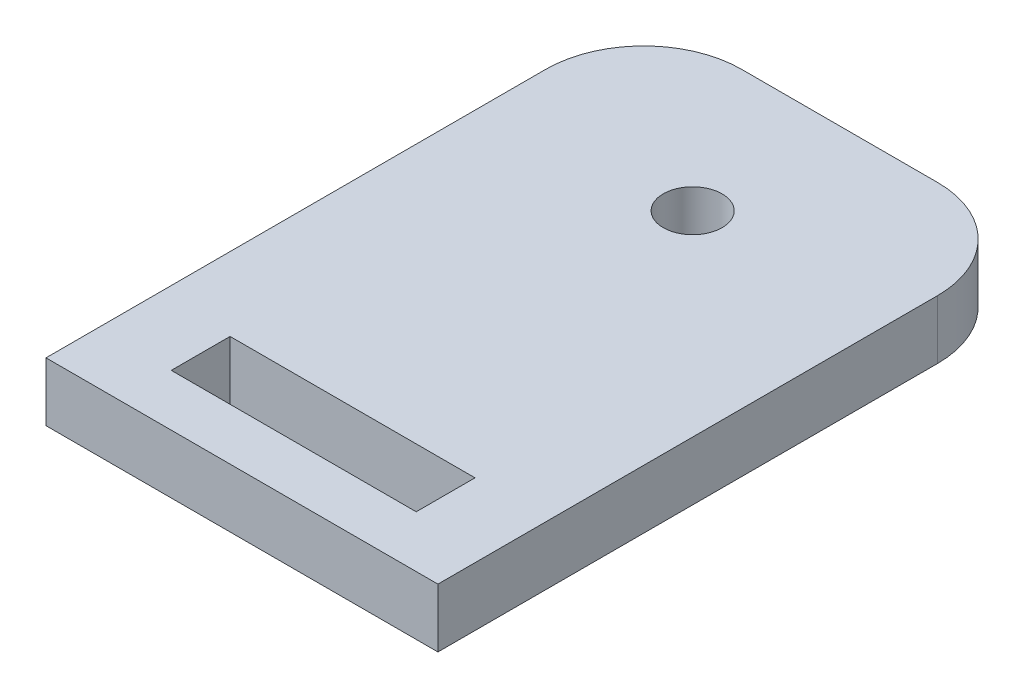
ISO-10303-21;
HEADER;
FILE_DESCRIPTION(('STEP AP214'),'2;1');
FILE_NAME('part.step','',(''),(''),'','','');
FILE_SCHEMA(('AUTOMOTIVE_DESIGN { 1 0 10303 214 1 1 1 1 }'));
ENDSEC;
DATA;
#1=APPLICATION_CONTEXT('core data for automotive mechanical design processes');
#2=APPLICATION_PROTOCOL_DEFINITION('international standard','automotive_design',2000,#1);
#3=PRODUCT_CONTEXT('',#1,'mechanical');
#4=PRODUCT('Part','Part','',(#3));
#5=PRODUCT_RELATED_PRODUCT_CATEGORY('part','',(#4));
#6=PRODUCT_DEFINITION_FORMATION('','',#4);
#7=PRODUCT_DEFINITION_CONTEXT('part definition',#1,'design');
#8=PRODUCT_DEFINITION('design','',#6,#7);
#9=PRODUCT_DEFINITION_SHAPE('','',#8);
#10=(LENGTH_UNIT() NAMED_UNIT(*) SI_UNIT(.MILLI.,.METRE.));
#11=(NAMED_UNIT(*) PLANE_ANGLE_UNIT() SI_UNIT($,.RADIAN.));
#12=(NAMED_UNIT(*) SI_UNIT($,.STERADIAN.) SOLID_ANGLE_UNIT());
#13=UNCERTAINTY_MEASURE_WITH_UNIT(LENGTH_MEASURE(1.E-05),#10,'distance_accuracy_value','');
#14=(GEOMETRIC_REPRESENTATION_CONTEXT(3) GLOBAL_UNCERTAINTY_ASSIGNED_CONTEXT((#13)) GLOBAL_UNIT_ASSIGNED_CONTEXT((#10,
#11,#12)) REPRESENTATION_CONTEXT('',''));
#15=CARTESIAN_POINT('',(0.,0.,0.));
#16=DIRECTION('',(0.,0.,1.));
#17=DIRECTION('',(1.,0.,0.));
#18=AXIS2_PLACEMENT_3D('',#15,#16,#17);
#19=CARTESIAN_POINT('',(11.0180026123847,6.,-23.5));
#20=DIRECTION('',(0.,-1.,0.));
#21=DIRECTION('',(0.,0.,-1.));
#22=AXIS2_PLACEMENT_3D('',#19,#20,#21);
#23=PLANE('',#22);
#24=CARTESIAN_POINT('',(11.0180026123847,6.,-23.5));
#25=DIRECTION('',(0.,1.,0.));
#26=DIRECTION('',(0.,0.,-1.));
#27=AXIS2_PLACEMENT_3D('',#24,#25,#26);
#28=CIRCLE('',#27,10.);
#29=CARTESIAN_POINT('',(21.0180026123847,6.,-23.5));
#30=VERTEX_POINT('',#29);
#31=CARTESIAN_POINT('',(11.0180026123847,6.,-33.5));
#32=VERTEX_POINT('',#31);
#33=EDGE_CURVE('E172',#30,#32,#28,.T.);
#34=ORIENTED_EDGE('',*,*,#33,.T.);
#35=DIRECTION('',(-1.,0.,0.));
#36=VECTOR('',#35,1.);
#37=CARTESIAN_POINT('',(-8.98199738761536,6.,-33.5));
#38=LINE('',#37,#36);
#39=CARTESIAN_POINT('',(-8.98199738761536,6.,-33.5));
#40=VERTEX_POINT('',#39);
#41=EDGE_CURVE('E176',#32,#40,#38,.T.);
#42=ORIENTED_EDGE('',*,*,#41,.T.);
#43=CARTESIAN_POINT('',(-8.98199738761536,6.,-23.5));
#44=DIRECTION('',(0.,1.,0.));
#45=DIRECTION('',(0.,0.,1.));
#46=AXIS2_PLACEMENT_3D('',#43,#44,#45);
#47=CIRCLE('',#46,10.);
#48=CARTESIAN_POINT('',(-18.9819973876154,6.,-23.5));
#49=VERTEX_POINT('',#48);
#50=EDGE_CURVE('E180',#40,#49,#47,.T.);
#51=ORIENTED_EDGE('',*,*,#50,.T.);
#52=DIRECTION('',(0.,0.,1.));
#53=VECTOR('',#52,1.);
#54=CARTESIAN_POINT('',(-18.9819973876154,6.,-23.5));
#55=LINE('',#54,#53);
#56=CARTESIAN_POINT('',(-18.9819973876154,6.,27.5));
#57=VERTEX_POINT('',#56);
#58=EDGE_CURVE('E183',#49,#57,#55,.T.);
#59=ORIENTED_EDGE('',*,*,#58,.T.);
#60=DIRECTION('',(1.,0.,0.));
#61=VECTOR('',#60,1.);
#62=CARTESIAN_POINT('',(-18.9819973876154,6.,27.5));
#63=LINE('',#62,#61);
#64=CARTESIAN_POINT('',(21.0180026123846,6.,27.5));
#65=VERTEX_POINT('',#64);
#66=EDGE_CURVE('E186',#57,#65,#63,.T.);
#67=ORIENTED_EDGE('',*,*,#66,.T.);
#68=DIRECTION('',(0.,0.,-1.));
#69=VECTOR('',#68,1.);
#70=CARTESIAN_POINT('',(21.0180026123847,6.,-23.5));
#71=LINE('',#70,#69);
#72=EDGE_CURVE('E189',#65,#30,#71,.T.);
#73=ORIENTED_EDGE('',*,*,#72,.T.);
#74=EDGE_LOOP('',(#34,#42,#51,#59,#67,#73));
#75=FACE_BOUND('',#74,.T.);
#76=DIRECTION('',(0.,0.,-1.));
#77=VECTOR('',#76,1.);
#78=CARTESIAN_POINT('',(13.5180026123847,6.,16.2143245070425));
#79=LINE('',#78,#77);
#80=CARTESIAN_POINT('',(13.5180026123847,6.,22.2143245070425));
#81=VERTEX_POINT('',#80);
#82=CARTESIAN_POINT('',(13.5180026123847,6.,16.2143245070425));
#83=VERTEX_POINT('',#82);
#84=EDGE_CURVE('E121',#81,#83,#79,.T.);
#85=ORIENTED_EDGE('',*,*,#84,.F.);
#86=DIRECTION('',(1.,0.,0.));
#87=VECTOR('',#86,1.);
#88=CARTESIAN_POINT('',(-11.4819973876154,6.,22.2143245070425));
#89=LINE('',#88,#87);
#90=CARTESIAN_POINT('',(-11.4819973876153,6.,22.2143245070425));
#91=VERTEX_POINT('',#90);
#92=EDGE_CURVE('E148',#91,#81,#89,.T.);
#93=ORIENTED_EDGE('',*,*,#92,.F.);
#94=DIRECTION('',(0.,0.,1.));
#95=VECTOR('',#94,1.);
#96=CARTESIAN_POINT('',(-11.4819973876154,6.,16.2143245070425));
#97=LINE('',#96,#95);
#98=CARTESIAN_POINT('',(-11.4819973876154,6.,16.2143245070425));
#99=VERTEX_POINT('',#98);
#100=EDGE_CURVE('E144',#99,#91,#97,.T.);
#101=ORIENTED_EDGE('',*,*,#100,.F.);
#102=DIRECTION('',(-1.,0.,0.));
#103=VECTOR('',#102,1.);
#104=CARTESIAN_POINT('',(-11.4819973876154,6.,16.2143245070425));
#105=LINE('',#104,#103);
#106=EDGE_CURVE('E130',#83,#99,#105,.T.);
#107=ORIENTED_EDGE('',*,*,#106,.F.);
#108=EDGE_LOOP('',(#85,#93,#101,#107));
#109=FACE_BOUND('',#108,.T.);
#110=CARTESIAN_POINT('',(1.01800261238465,6.,-18.5));
#111=DIRECTION('',(0.,1.,0.));
#112=DIRECTION('',(0.,0.,1.));
#113=AXIS2_PLACEMENT_3D('',#110,#111,#112);
#114=CIRCLE('',#113,3.);
#115=CARTESIAN_POINT('',(1.01800261238465,6.,-15.5));
#116=VERTEX_POINT('',#115);
#117=EDGE_CURVE('E156',#116,#116,#114,.T.);
#118=ORIENTED_EDGE('',*,*,#117,.F.);
#119=EDGE_LOOP('',(#118));
#120=FACE_BOUND('',#119,.T.);
#121=ADVANCED_FACE('F43',(#75,#109,#120),#23,.F.);
#122=CARTESIAN_POINT('',(11.0180026123847,0.,-23.5));
#123=DIRECTION('',(0.,-1.,0.));
#124=DIRECTION('',(0.,0.,-1.));
#125=AXIS2_PLACEMENT_3D('',#122,#123,#124);
#126=PLANE('',#125);
#127=DIRECTION('',(1.,0.,0.));
#128=VECTOR('',#127,1.);
#129=CARTESIAN_POINT('',(-11.4819973876154,0.,22.2143245070425));
#130=LINE('',#129,#128);
#131=CARTESIAN_POINT('',(-11.4819973876154,0.,22.2143245070425));
#132=VERTEX_POINT('',#131);
#133=CARTESIAN_POINT('',(13.5180026123847,0.,22.2143245070425));
#134=VERTEX_POINT('',#133);
#135=EDGE_CURVE('E131',#132,#134,#130,.T.);
#136=ORIENTED_EDGE('',*,*,#135,.T.);
#137=DIRECTION('',(0.,0.,-1.));
#138=VECTOR('',#137,1.);
#139=CARTESIAN_POINT('',(13.5180026123847,0.,16.2143245070425));
#140=LINE('',#139,#138);
#141=CARTESIAN_POINT('',(13.5180026123847,0.,16.2143245070425));
#142=VERTEX_POINT('',#141);
#143=EDGE_CURVE('E67',#134,#142,#140,.T.);
#144=ORIENTED_EDGE('',*,*,#143,.T.);
#145=DIRECTION('',(-1.,0.,0.));
#146=VECTOR('',#145,1.);
#147=CARTESIAN_POINT('',(-11.4819973876154,0.,16.2143245070425));
#148=LINE('',#147,#146);
#149=CARTESIAN_POINT('',(-11.4819973876154,0.,16.2143245070425));
#150=VERTEX_POINT('',#149);
#151=EDGE_CURVE('E137',#142,#150,#148,.T.);
#152=ORIENTED_EDGE('',*,*,#151,.T.);
#153=DIRECTION('',(0.,0.,1.));
#154=VECTOR('',#153,1.);
#155=CARTESIAN_POINT('',(-11.4819973876154,0.,16.2143245070425));
#156=LINE('',#155,#154);
#157=EDGE_CURVE('E159',#150,#132,#156,.T.);
#158=ORIENTED_EDGE('',*,*,#157,.T.);
#159=EDGE_LOOP('',(#136,#144,#152,#158));
#160=FACE_BOUND('',#159,.T.);
#161=CARTESIAN_POINT('',(11.0180026123847,0.,-23.5));
#162=DIRECTION('',(0.,1.,0.));
#163=DIRECTION('',(0.,0.,-1.));
#164=AXIS2_PLACEMENT_3D('',#161,#162,#163);
#165=CIRCLE('',#164,10.);
#166=CARTESIAN_POINT('',(21.0180026123847,0.,-23.5));
#167=VERTEX_POINT('',#166);
#168=CARTESIAN_POINT('',(11.0180026123847,0.,-33.5));
#169=VERTEX_POINT('',#168);
#170=EDGE_CURVE('E139',#167,#169,#165,.T.);
#171=ORIENTED_EDGE('',*,*,#170,.F.);
#172=DIRECTION('',(0.,0.,-1.));
#173=VECTOR('',#172,1.);
#174=CARTESIAN_POINT('',(21.0180026123847,0.,-23.5));
#175=LINE('',#174,#173);
#176=CARTESIAN_POINT('',(21.0180026123846,0.,27.5));
#177=VERTEX_POINT('',#176);
#178=EDGE_CURVE('E177',#177,#167,#175,.T.);
#179=ORIENTED_EDGE('',*,*,#178,.F.);
#180=DIRECTION('',(1.,0.,0.));
#181=VECTOR('',#180,1.);
#182=CARTESIAN_POINT('',(-18.9819973876154,0.,27.5));
#183=LINE('',#182,#181);
#184=CARTESIAN_POINT('',(-18.9819973876154,0.,27.5));
#185=VERTEX_POINT('',#184);
#186=EDGE_CURVE('E205',#185,#177,#183,.T.);
#187=ORIENTED_EDGE('',*,*,#186,.F.);
#188=DIRECTION('',(0.,0.,1.));
#189=VECTOR('',#188,1.);
#190=CARTESIAN_POINT('',(-18.9819973876154,0.,-23.5));
#191=LINE('',#190,#189);
#192=CARTESIAN_POINT('',(-18.9819973876154,0.,-23.5));
#193=VERTEX_POINT('',#192);
#194=EDGE_CURVE('E202',#193,#185,#191,.T.);
#195=ORIENTED_EDGE('',*,*,#194,.F.);
#196=CARTESIAN_POINT('',(-8.98199738761536,0.,-23.5));
#197=DIRECTION('',(0.,1.,0.));
#198=DIRECTION('',(0.,0.,1.));
#199=AXIS2_PLACEMENT_3D('',#196,#197,#198);
#200=CIRCLE('',#199,10.);
#201=CARTESIAN_POINT('',(-8.98199738761536,0.,-33.5));
#202=VERTEX_POINT('',#201);
#203=EDGE_CURVE('E199',#202,#193,#200,.T.);
#204=ORIENTED_EDGE('',*,*,#203,.F.);
#205=DIRECTION('',(-1.,0.,0.));
#206=VECTOR('',#205,1.);
#207=CARTESIAN_POINT('',(-8.98199738761536,0.,-33.5));
#208=LINE('',#207,#206);
#209=EDGE_CURVE('E196',#169,#202,#208,.T.);
#210=ORIENTED_EDGE('',*,*,#209,.F.);
#211=EDGE_LOOP('',(#171,#179,#187,#195,#204,#210));
#212=FACE_BOUND('',#211,.T.);
#213=CARTESIAN_POINT('',(1.01800261238465,0.,-18.5));
#214=DIRECTION('',(0.,1.,0.));
#215=DIRECTION('',(0.,0.,1.));
#216=AXIS2_PLACEMENT_3D('',#213,#214,#215);
#217=CIRCLE('',#216,3.);
#218=CARTESIAN_POINT('',(1.01800261238465,0.,-15.5));
#219=VERTEX_POINT('',#218);
#220=EDGE_CURVE('E292',#219,#219,#217,.T.);
#221=ORIENTED_EDGE('',*,*,#220,.T.);
#222=EDGE_LOOP('',(#221));
#223=FACE_BOUND('',#222,.T.);
#224=ADVANCED_FACE('F236',(#160,#212,#223),#126,.T.);
#225=CARTESIAN_POINT('',(11.0180026123847,6.,-23.5));
#226=DIRECTION('',(0.,-1.,0.));
#227=DIRECTION('',(0.,0.,-1.));
#228=AXIS2_PLACEMENT_3D('',#225,#226,#227);
#229=CYLINDRICAL_SURFACE('',#228,10.);
#230=ORIENTED_EDGE('',*,*,#170,.T.);
#231=DIRECTION('',(0.,-1.,0.));
#232=VECTOR('',#231,1.);
#233=CARTESIAN_POINT('',(11.0180026123847,6.,-33.5));
#234=LINE('',#233,#232);
#235=EDGE_CURVE('E11',#32,#169,#234,.T.);
#236=ORIENTED_EDGE('',*,*,#235,.F.);
#237=ORIENTED_EDGE('',*,*,#33,.F.);
#238=DIRECTION('',(0.,-1.,0.));
#239=VECTOR('',#238,1.);
#240=CARTESIAN_POINT('',(21.0180026123847,6.,-23.5));
#241=LINE('',#240,#239);
#242=EDGE_CURVE('E192',#30,#167,#241,.T.);
#243=ORIENTED_EDGE('',*,*,#242,.T.);
#244=EDGE_LOOP('',(#230,#236,#237,#243));
#245=FACE_BOUND('',#244,.T.);
#246=ADVANCED_FACE('F45',(#245),#229,.T.);
#247=CARTESIAN_POINT('',(-8.98199738761536,6.,-33.5));
#248=DIRECTION('',(0.,0.,1.));
#249=DIRECTION('',(1.,0.,0.));
#250=AXIS2_PLACEMENT_3D('',#247,#248,#249);
#251=PLANE('',#250);
#252=ORIENTED_EDGE('',*,*,#209,.T.);
#253=DIRECTION('',(0.,-1.,0.));
#254=VECTOR('',#253,1.);
#255=CARTESIAN_POINT('',(-8.98199738761536,6.,-33.5));
#256=LINE('',#255,#254);
#257=EDGE_CURVE('E52',#40,#202,#256,.T.);
#258=ORIENTED_EDGE('',*,*,#257,.F.);
#259=ORIENTED_EDGE('',*,*,#41,.F.);
#260=ORIENTED_EDGE('',*,*,#235,.T.);
#261=EDGE_LOOP('',(#252,#258,#259,#260));
#262=FACE_BOUND('',#261,.T.);
#263=ADVANCED_FACE('F253',(#262),#251,.F.);
#264=CARTESIAN_POINT('',(-8.98199738761536,6.,-23.5));
#265=DIRECTION('',(0.,-1.,0.));
#266=DIRECTION('',(0.,0.,-1.));
#267=AXIS2_PLACEMENT_3D('',#264,#265,#266);
#268=CYLINDRICAL_SURFACE('',#267,10.);
#269=ORIENTED_EDGE('',*,*,#203,.T.);
#270=DIRECTION('',(0.,-1.,0.));
#271=VECTOR('',#270,1.);
#272=CARTESIAN_POINT('',(-18.9819973876154,6.,-23.5));
#273=LINE('',#272,#271);
#274=EDGE_CURVE('E221',#49,#193,#273,.T.);
#275=ORIENTED_EDGE('',*,*,#274,.F.);
#276=ORIENTED_EDGE('',*,*,#50,.F.);
#277=ORIENTED_EDGE('',*,*,#257,.T.);
#278=EDGE_LOOP('',(#269,#275,#276,#277));
#279=FACE_BOUND('',#278,.T.);
#280=ADVANCED_FACE('F230',(#279),#268,.T.);
#281=CARTESIAN_POINT('',(-18.9819973876154,6.,-23.5));
#282=DIRECTION('',(1.,0.,0.));
#283=DIRECTION('',(0.,0.,-1.));
#284=AXIS2_PLACEMENT_3D('',#281,#282,#283);
#285=PLANE('',#284);
#286=ORIENTED_EDGE('',*,*,#194,.T.);
#287=DIRECTION('',(0.,-1.,0.));
#288=VECTOR('',#287,1.);
#289=CARTESIAN_POINT('',(-18.9819973876154,6.,27.5));
#290=LINE('',#289,#288);
#291=EDGE_CURVE('E217',#57,#185,#290,.T.);
#292=ORIENTED_EDGE('',*,*,#291,.F.);
#293=ORIENTED_EDGE('',*,*,#58,.F.);
#294=ORIENTED_EDGE('',*,*,#274,.T.);
#295=EDGE_LOOP('',(#286,#292,#293,#294));
#296=FACE_BOUND('',#295,.T.);
#297=ADVANCED_FACE('F242',(#296),#285,.F.);
#298=CARTESIAN_POINT('',(-18.9819973876154,6.,27.5));
#299=DIRECTION('',(0.,0.,-1.));
#300=DIRECTION('',(-1.,0.,0.));
#301=AXIS2_PLACEMENT_3D('',#298,#299,#300);
#302=PLANE('',#301);
#303=ORIENTED_EDGE('',*,*,#186,.T.);
#304=DIRECTION('',(0.,-1.,0.));
#305=VECTOR('',#304,1.);
#306=CARTESIAN_POINT('',(21.0180026123846,6.,27.5));
#307=LINE('',#306,#305);
#308=EDGE_CURVE('E213',#65,#177,#307,.T.);
#309=ORIENTED_EDGE('',*,*,#308,.F.);
#310=ORIENTED_EDGE('',*,*,#66,.F.);
#311=ORIENTED_EDGE('',*,*,#291,.T.);
#312=EDGE_LOOP('',(#303,#309,#310,#311));
#313=FACE_BOUND('',#312,.T.);
#314=ADVANCED_FACE('F246',(#313),#302,.F.);
#315=CARTESIAN_POINT('',(21.0180026123847,6.,-23.5));
#316=DIRECTION('',(-1.,0.,0.));
#317=DIRECTION('',(0.,0.,1.));
#318=AXIS2_PLACEMENT_3D('',#315,#316,#317);
#319=PLANE('',#318);
#320=ORIENTED_EDGE('',*,*,#178,.T.);
#321=ORIENTED_EDGE('',*,*,#242,.F.);
#322=ORIENTED_EDGE('',*,*,#72,.F.);
#323=ORIENTED_EDGE('',*,*,#308,.T.);
#324=EDGE_LOOP('',(#320,#321,#322,#323));
#325=FACE_BOUND('',#324,.T.);
#326=ADVANCED_FACE('F256',(#325),#319,.F.);
#327=CARTESIAN_POINT('',(13.5180026123847,6.,16.2143245070425));
#328=DIRECTION('',(-1.,0.,0.));
#329=DIRECTION('',(0.,0.,1.));
#330=AXIS2_PLACEMENT_3D('',#327,#328,#329);
#331=PLANE('',#330);
#332=ORIENTED_EDGE('',*,*,#143,.F.);
#333=DIRECTION('',(0.,-1.,0.));
#334=VECTOR('',#333,1.);
#335=CARTESIAN_POINT('',(13.5180026123847,6.,22.2143245070425));
#336=LINE('',#335,#334);
#337=EDGE_CURVE('E125',#81,#134,#336,.T.);
#338=ORIENTED_EDGE('',*,*,#337,.F.);
#339=ORIENTED_EDGE('',*,*,#84,.T.);
#340=DIRECTION('',(0.,-1.,0.));
#341=VECTOR('',#340,1.);
#342=CARTESIAN_POINT('',(13.5180026123847,6.,16.2143245070425));
#343=LINE('',#342,#341);
#344=EDGE_CURVE('E124',#83,#142,#343,.T.);
#345=ORIENTED_EDGE('',*,*,#344,.T.);
#346=EDGE_LOOP('',(#332,#338,#339,#345));
#347=FACE_BOUND('',#346,.T.);
#348=ADVANCED_FACE('F123',(#347),#331,.T.);
#349=CARTESIAN_POINT('',(-11.4819973876154,6.,16.2143245070425));
#350=DIRECTION('',(0.,0.,1.));
#351=DIRECTION('',(1.,0.,0.));
#352=AXIS2_PLACEMENT_3D('',#349,#350,#351);
#353=PLANE('',#352);
#354=ORIENTED_EDGE('',*,*,#151,.F.);
#355=ORIENTED_EDGE('',*,*,#344,.F.);
#356=ORIENTED_EDGE('',*,*,#106,.T.);
#357=DIRECTION('',(0.,-1.,0.));
#358=VECTOR('',#357,1.);
#359=CARTESIAN_POINT('',(-11.4819973876154,6.,16.2143245070425));
#360=LINE('',#359,#358);
#361=EDGE_CURVE('E140',#99,#150,#360,.T.);
#362=ORIENTED_EDGE('',*,*,#361,.T.);
#363=EDGE_LOOP('',(#354,#355,#356,#362));
#364=FACE_BOUND('',#363,.T.);
#365=ADVANCED_FACE('F134',(#364),#353,.T.);
#366=CARTESIAN_POINT('',(-11.4819973876154,6.,16.2143245070425));
#367=DIRECTION('',(1.,0.,0.));
#368=DIRECTION('',(0.,0.,-1.));
#369=AXIS2_PLACEMENT_3D('',#366,#367,#368);
#370=PLANE('',#369);
#371=ORIENTED_EDGE('',*,*,#157,.F.);
#372=ORIENTED_EDGE('',*,*,#361,.F.);
#373=ORIENTED_EDGE('',*,*,#100,.T.);
#374=DIRECTION('',(0.,-1.,0.));
#375=VECTOR('',#374,1.);
#376=CARTESIAN_POINT('',(-11.4819973876154,6.,22.2143245070425));
#377=LINE('',#376,#375);
#378=EDGE_CURVE('E59',#91,#132,#377,.T.);
#379=ORIENTED_EDGE('',*,*,#378,.T.);
#380=EDGE_LOOP('',(#371,#372,#373,#379));
#381=FACE_BOUND('',#380,.T.);
#382=ADVANCED_FACE('F275',(#381),#370,.T.);
#383=CARTESIAN_POINT('',(-11.4819973876154,6.,22.2143245070425));
#384=DIRECTION('',(0.,0.,-1.));
#385=DIRECTION('',(-1.,0.,0.));
#386=AXIS2_PLACEMENT_3D('',#383,#384,#385);
#387=PLANE('',#386);
#388=ORIENTED_EDGE('',*,*,#135,.F.);
#389=ORIENTED_EDGE('',*,*,#378,.F.);
#390=ORIENTED_EDGE('',*,*,#92,.T.);
#391=ORIENTED_EDGE('',*,*,#337,.T.);
#392=EDGE_LOOP('',(#388,#389,#390,#391));
#393=FACE_BOUND('',#392,.T.);
#394=ADVANCED_FACE('F278',(#393),#387,.T.);
#395=CARTESIAN_POINT('',(1.01800261238465,6.,-18.5));
#396=DIRECTION('',(0.,-1.,0.));
#397=DIRECTION('',(0.,0.,-1.));
#398=AXIS2_PLACEMENT_3D('',#395,#396,#397);
#399=CYLINDRICAL_SURFACE('',#398,3.);
#400=ORIENTED_EDGE('',*,*,#117,.T.);
#401=EDGE_LOOP('',(#400));
#402=FACE_BOUND('',#401,.T.);
#403=ORIENTED_EDGE('',*,*,#220,.F.);
#404=EDGE_LOOP('',(#403));
#405=FACE_BOUND('',#404,.T.);
#406=ADVANCED_FACE('F282',(#402,#405),#399,.F.);
#407=CLOSED_SHELL('',(#121,#224,#246,#263,#280,#297,#314,#326,#348,#365,#382,#394,#406));
#408=MANIFOLD_SOLID_BREP('B2',#407);
#409=ADVANCED_BREP_SHAPE_REPRESENTATION('',(#18,#408),#14);
#410=SHAPE_DEFINITION_REPRESENTATION(#9,#409);
ENDSEC;
END-ISO-10303-21;
